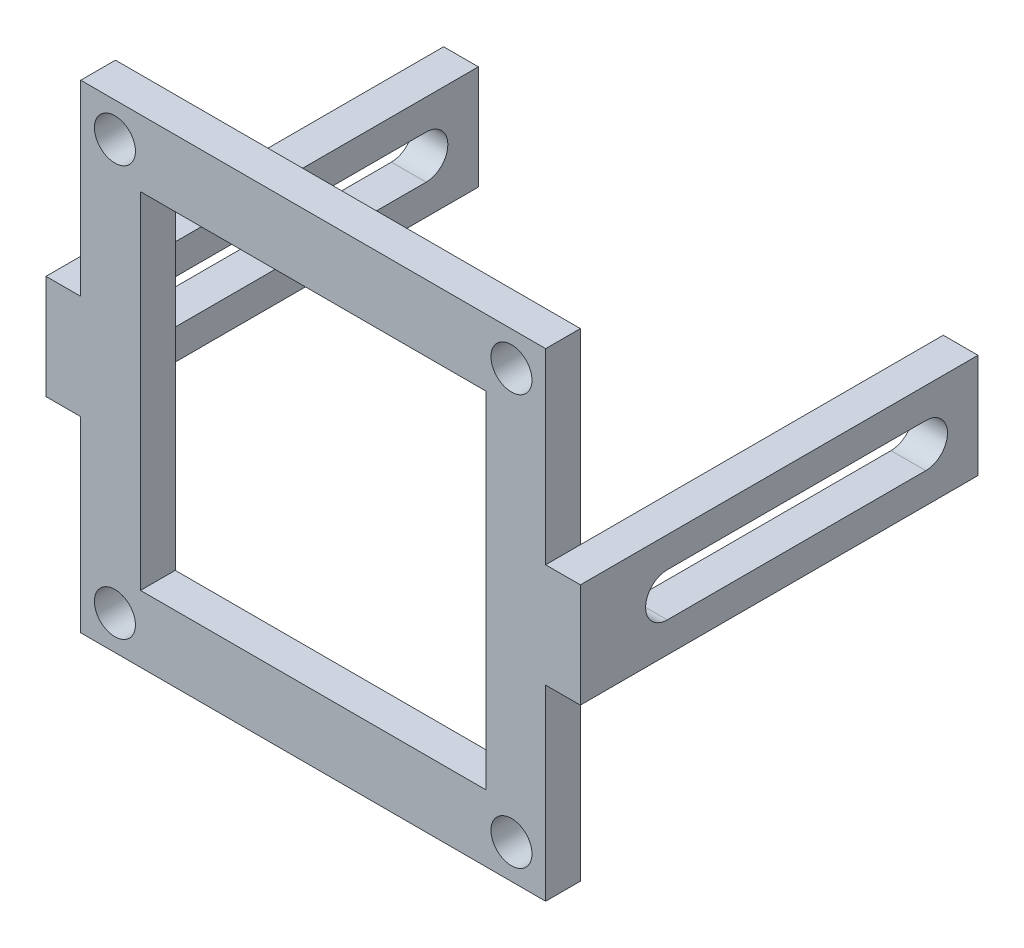
ISO-10303-21;
HEADER;
FILE_DESCRIPTION(('STEP AP214'),'2;1');
FILE_NAME('part.step','',(''),(''),'','','');
FILE_SCHEMA(('AUTOMOTIVE_DESIGN { 1 0 10303 214 1 1 1 1 }'));
ENDSEC;
DATA;
#1=APPLICATION_CONTEXT('core data for automotive mechanical design processes');
#2=APPLICATION_PROTOCOL_DEFINITION('international standard','automotive_design',2000,#1);
#3=PRODUCT_CONTEXT('',#1,'mechanical');
#4=PRODUCT('Part','Part','',(#3));
#5=PRODUCT_RELATED_PRODUCT_CATEGORY('part','',(#4));
#6=PRODUCT_DEFINITION_FORMATION('','',#4);
#7=PRODUCT_DEFINITION_CONTEXT('part definition',#1,'design');
#8=PRODUCT_DEFINITION('design','',#6,#7);
#9=PRODUCT_DEFINITION_SHAPE('','',#8);
#10=(LENGTH_UNIT() NAMED_UNIT(*) SI_UNIT(.MILLI.,.METRE.));
#11=(NAMED_UNIT(*) PLANE_ANGLE_UNIT() SI_UNIT($,.RADIAN.));
#12=(NAMED_UNIT(*) SI_UNIT($,.STERADIAN.) SOLID_ANGLE_UNIT());
#13=UNCERTAINTY_MEASURE_WITH_UNIT(LENGTH_MEASURE(1.E-05),#10,'distance_accuracy_value','');
#14=(GEOMETRIC_REPRESENTATION_CONTEXT(3) GLOBAL_UNCERTAINTY_ASSIGNED_CONTEXT((#13)) GLOBAL_UNIT_ASSIGNED_CONTEXT((#10,
#11,#12)) REPRESENTATION_CONTEXT('',''));
#15=CARTESIAN_POINT('',(0.,0.,0.));
#16=DIRECTION('',(0.,0.,1.));
#17=DIRECTION('',(1.,0.,0.));
#18=AXIS2_PLACEMENT_3D('',#15,#16,#17);
#19=CARTESIAN_POINT('',(17.,32.8650742494496,92.255589270182));
#20=DIRECTION('',(-1.,0.,0.));
#21=DIRECTION('',(0.,0.,1.));
#22=AXIS2_PLACEMENT_3D('',#19,#20,#21);
#23=PLANE('',#22);
#24=DIRECTION('',(0.,1.,0.));
#25=VECTOR('',#24,1.);
#26=CARTESIAN_POINT('',(17.,32.8650742494496,92.255589270182));
#27=LINE('',#26,#25);
#28=CARTESIAN_POINT('',(17.,19.1750742494496,92.255589270182));
#29=VERTEX_POINT('',#28);
#30=CARTESIAN_POINT('',(17.,32.8650742494496,92.255589270182));
#31=VERTEX_POINT('',#30);
#32=EDGE_CURVE('E403',#29,#31,#27,.T.);
#33=ORIENTED_EDGE('',*,*,#32,.F.);
#34=DIRECTION('',(0.,0.,-1.));
#35=VECTOR('',#34,1.);
#36=CARTESIAN_POINT('',(17.,19.1750742494496,63.1769712690575));
#37=LINE('',#36,#35);
#38=CARTESIAN_POINT('',(17.,19.1750742494496,89.715589270182));
#39=VERTEX_POINT('',#38);
#40=EDGE_CURVE('E259',#29,#39,#37,.T.);
#41=ORIENTED_EDGE('',*,*,#40,.T.);
#42=DIRECTION('',(0.,1.,0.));
#43=VECTOR('',#42,1.);
#44=CARTESIAN_POINT('',(17.,32.8650742494496,89.715589270182));
#45=LINE('',#44,#43);
#46=CARTESIAN_POINT('',(17.,32.8650742494496,89.715589270182));
#47=VERTEX_POINT('',#46);
#48=EDGE_CURVE('E415',#39,#47,#45,.T.);
#49=ORIENTED_EDGE('',*,*,#48,.T.);
#50=DIRECTION('',(0.,0.,-1.));
#51=VECTOR('',#50,1.);
#52=CARTESIAN_POINT('',(17.,32.8650742494496,92.255589270182));
#53=LINE('',#52,#51);
#54=EDGE_CURVE('E424',#31,#47,#53,.T.);
#55=ORIENTED_EDGE('',*,*,#54,.F.);
#56=EDGE_LOOP('',(#33,#41,#49,#55));
#57=FACE_BOUND('',#56,.T.);
#58=ADVANCED_FACE('F37',(#57),#23,.F.);
#59=CARTESIAN_POINT('',(-17.,32.8650742494496,92.255589270182));
#60=DIRECTION('',(1.,0.,0.));
#61=DIRECTION('',(0.,0.,-1.));
#62=AXIS2_PLACEMENT_3D('',#59,#60,#61);
#63=PLANE('',#62);
#64=DIRECTION('',(0.,0.,-1.));
#65=VECTOR('',#64,1.);
#66=CARTESIAN_POINT('',(-17.,19.1750742494496,63.1769712690575));
#67=LINE('',#66,#65);
#68=CARTESIAN_POINT('',(-17.,19.1750742494496,92.255589270182));
#69=VERTEX_POINT('',#68);
#70=CARTESIAN_POINT('',(-17.,19.1750742494496,89.715589270182));
#71=VERTEX_POINT('',#70);
#72=EDGE_CURVE('E62',#69,#71,#67,.T.);
#73=ORIENTED_EDGE('',*,*,#72,.F.);
#74=DIRECTION('',(0.,-1.,0.));
#75=VECTOR('',#74,1.);
#76=CARTESIAN_POINT('',(-17.,32.8650742494496,92.255589270182));
#77=LINE('',#76,#75);
#78=CARTESIAN_POINT('',(-17.,32.8650742494496,92.255589270182));
#79=VERTEX_POINT('',#78);
#80=EDGE_CURVE('E398',#79,#69,#77,.T.);
#81=ORIENTED_EDGE('',*,*,#80,.F.);
#82=DIRECTION('',(0.,0.,-1.));
#83=VECTOR('',#82,1.);
#84=CARTESIAN_POINT('',(-17.,32.8650742494496,92.255589270182));
#85=LINE('',#84,#83);
#86=CARTESIAN_POINT('',(-17.,32.8650742494496,89.715589270182));
#87=VERTEX_POINT('',#86);
#88=EDGE_CURVE('E409',#79,#87,#85,.T.);
#89=ORIENTED_EDGE('',*,*,#88,.T.);
#90=DIRECTION('',(0.,-1.,0.));
#91=VECTOR('',#90,1.);
#92=CARTESIAN_POINT('',(-17.,32.8650742494496,89.715589270182));
#93=LINE('',#92,#91);
#94=EDGE_CURVE('E410',#87,#71,#93,.T.);
#95=ORIENTED_EDGE('',*,*,#94,.T.);
#96=EDGE_LOOP('',(#73,#81,#89,#95));
#97=FACE_BOUND('',#96,.T.);
#98=ADVANCED_FACE('F39',(#97),#63,.F.);
#99=DIRECTION('',(0.,0.,1.));
#100=VECTOR('',#99,1.);
#101=CARTESIAN_POINT('',(-17.,11.5550742494496,89.715589270182));
#102=LINE('',#101,#100);
#103=CARTESIAN_POINT('',(-17.,11.5550742494496,89.715589270182));
#104=VERTEX_POINT('',#103);
#105=CARTESIAN_POINT('',(-17.,11.5550742494496,92.255589270182));
#106=VERTEX_POINT('',#105);
#107=EDGE_CURVE('E46',#104,#106,#102,.T.);
#108=ORIENTED_EDGE('',*,*,#107,.F.);
#109=CARTESIAN_POINT('',(-17.,-2.13492575055037,89.715589270182));
#110=VERTEX_POINT('',#109);
#111=EDGE_CURVE('E397',#104,#110,#93,.T.);
#112=ORIENTED_EDGE('',*,*,#111,.T.);
#113=DIRECTION('',(0.,0.,-1.));
#114=VECTOR('',#113,1.);
#115=CARTESIAN_POINT('',(-17.,-2.13492575055037,92.255589270182));
#116=LINE('',#115,#114);
#117=CARTESIAN_POINT('',(-17.,-2.13492575055037,92.255589270182));
#118=VERTEX_POINT('',#117);
#119=EDGE_CURVE('E41',#118,#110,#116,.T.);
#120=ORIENTED_EDGE('',*,*,#119,.F.);
#121=EDGE_CURVE('E401',#106,#118,#77,.T.);
#122=ORIENTED_EDGE('',*,*,#121,.F.);
#123=EDGE_LOOP('',(#108,#112,#120,#122));
#124=FACE_BOUND('',#123,.T.);
#125=ADVANCED_FACE('F465',(#124),#63,.F.);
#126=CARTESIAN_POINT('',(0.,0.,92.255589270182));
#127=DIRECTION('',(0.,0.,1.));
#128=DIRECTION('',(1.,0.,0.));
#129=AXIS2_PLACEMENT_3D('',#126,#127,#128);
#130=PLANE('',#129);
#131=CARTESIAN_POINT('',(14.5,0.365074249449635,92.255589270182));
#132=DIRECTION('',(0.,0.,1.));
#133=DIRECTION('',(1.,0.,0.));
#134=AXIS2_PLACEMENT_3D('',#131,#132,#133);
#135=CIRCLE('',#134,1.5);
#136=CARTESIAN_POINT('',(16.,0.365074249449635,92.255589270182));
#137=VERTEX_POINT('',#136);
#138=EDGE_CURVE('E349',#137,#137,#135,.T.);
#139=ORIENTED_EDGE('',*,*,#138,.F.);
#140=EDGE_LOOP('',(#139));
#141=FACE_BOUND('',#140,.T.);
#142=CARTESIAN_POINT('',(-14.5,30.3650742494496,92.255589270182));
#143=DIRECTION('',(0.,0.,1.));
#144=DIRECTION('',(1.,0.,0.));
#145=AXIS2_PLACEMENT_3D('',#142,#143,#144);
#146=CIRCLE('',#145,1.5);
#147=CARTESIAN_POINT('',(-13.,30.3650742494496,92.255589270182));
#148=VERTEX_POINT('',#147);
#149=EDGE_CURVE('E361',#148,#148,#146,.T.);
#150=ORIENTED_EDGE('',*,*,#149,.F.);
#151=EDGE_LOOP('',(#150));
#152=FACE_BOUND('',#151,.T.);
#153=ORIENTED_EDGE('',*,*,#80,.T.);
#154=DIRECTION('',(1.,0.,0.));
#155=VECTOR('',#154,1.);
#156=CARTESIAN_POINT('',(-19.54,19.1750742494496,92.255589270182));
#157=LINE('',#156,#155);
#158=CARTESIAN_POINT('',(-19.54,19.1750742494496,92.255589270182));
#159=VERTEX_POINT('',#158);
#160=EDGE_CURVE('E324',#159,#69,#157,.T.);
#161=ORIENTED_EDGE('',*,*,#160,.F.);
#162=DIRECTION('',(0.,1.,0.));
#163=VECTOR('',#162,1.);
#164=CARTESIAN_POINT('',(-19.54,11.5550742494496,92.255589270182));
#165=LINE('',#164,#163);
#166=CARTESIAN_POINT('',(-19.54,11.5550742494496,92.255589270182));
#167=VERTEX_POINT('',#166);
#168=EDGE_CURVE('E322',#167,#159,#165,.T.);
#169=ORIENTED_EDGE('',*,*,#168,.F.);
#170=DIRECTION('',(1.,0.,0.));
#171=VECTOR('',#170,1.);
#172=CARTESIAN_POINT('',(-19.54,11.5550742494496,92.255589270182));
#173=LINE('',#172,#171);
#174=EDGE_CURVE('E333',#167,#106,#173,.T.);
#175=ORIENTED_EDGE('',*,*,#174,.T.);
#176=ORIENTED_EDGE('',*,*,#121,.T.);
#177=DIRECTION('',(1.,0.,0.));
#178=VECTOR('',#177,1.);
#179=CARTESIAN_POINT('',(-17.,-2.13492575055037,92.255589270182));
#180=LINE('',#179,#178);
#181=CARTESIAN_POINT('',(17.,-2.13492575055037,92.255589270182));
#182=VERTEX_POINT('',#181);
#183=EDGE_CURVE('E400',#118,#182,#180,.T.);
#184=ORIENTED_EDGE('',*,*,#183,.T.);
#185=CARTESIAN_POINT('',(17.,11.5550742494496,92.255589270182));
#186=VERTEX_POINT('',#185);
#187=EDGE_CURVE('E404',#182,#186,#27,.T.);
#188=ORIENTED_EDGE('',*,*,#187,.T.);
#189=DIRECTION('',(-1.,0.,0.));
#190=VECTOR('',#189,1.);
#191=CARTESIAN_POINT('',(19.54,11.5550742494496,92.255589270182));
#192=LINE('',#191,#190);
#193=CARTESIAN_POINT('',(19.54,11.5550742494496,92.255589270182));
#194=VERTEX_POINT('',#193);
#195=EDGE_CURVE('E55',#194,#186,#192,.T.);
#196=ORIENTED_EDGE('',*,*,#195,.F.);
#197=DIRECTION('',(0.,1.,0.));
#198=VECTOR('',#197,1.);
#199=CARTESIAN_POINT('',(19.54,11.5550742494496,92.255589270182));
#200=LINE('',#199,#198);
#201=CARTESIAN_POINT('',(19.54,19.1750742494496,92.255589270182));
#202=VERTEX_POINT('',#201);
#203=EDGE_CURVE('E258',#194,#202,#200,.T.);
#204=ORIENTED_EDGE('',*,*,#203,.T.);
#205=DIRECTION('',(-1.,0.,0.));
#206=VECTOR('',#205,1.);
#207=CARTESIAN_POINT('',(19.54,19.1750742494496,92.255589270182));
#208=LINE('',#207,#206);
#209=EDGE_CURVE('E280',#202,#29,#208,.T.);
#210=ORIENTED_EDGE('',*,*,#209,.T.);
#211=ORIENTED_EDGE('',*,*,#32,.T.);
#212=DIRECTION('',(-1.,0.,0.));
#213=VECTOR('',#212,1.);
#214=CARTESIAN_POINT('',(-17.,32.8650742494496,92.255589270182));
#215=LINE('',#214,#213);
#216=EDGE_CURVE('E407',#31,#79,#215,.T.);
#217=ORIENTED_EDGE('',*,*,#216,.T.);
#218=EDGE_LOOP('',(#153,#161,#169,#175,#176,#184,#188,#196,#204,#210,#211,#217));
#219=FACE_BOUND('',#218,.T.);
#220=DIRECTION('',(1.,0.,0.));
#221=VECTOR('',#220,1.);
#222=CARTESIAN_POINT('',(-12.6270234275931,2.73805082185656,92.255589270182));
#223=LINE('',#222,#221);
#224=CARTESIAN_POINT('',(-12.6270234275931,2.73805082185656,92.255589270182));
#225=VERTEX_POINT('',#224);
#226=CARTESIAN_POINT('',(12.6270234275931,2.73805082185656,92.255589270182));
#227=VERTEX_POINT('',#226);
#228=EDGE_CURVE('E369',#225,#227,#223,.T.);
#229=ORIENTED_EDGE('',*,*,#228,.F.);
#230=DIRECTION('',(0.,-1.,0.));
#231=VECTOR('',#230,1.);
#232=CARTESIAN_POINT('',(-12.6270234275931,2.73805082185656,92.255589270182));
#233=LINE('',#232,#231);
#234=CARTESIAN_POINT('',(-12.6270234275931,27.9920976770427,92.255589270182));
#235=VERTEX_POINT('',#234);
#236=EDGE_CURVE('E367',#235,#225,#233,.T.);
#237=ORIENTED_EDGE('',*,*,#236,.F.);
#238=DIRECTION('',(-1.,0.,0.));
#239=VECTOR('',#238,1.);
#240=CARTESIAN_POINT('',(-12.6270234275931,27.9920976770427,92.255589270182));
#241=LINE('',#240,#239);
#242=CARTESIAN_POINT('',(12.6270234275931,27.9920976770427,92.255589270182));
#243=VERTEX_POINT('',#242);
#244=EDGE_CURVE('E375',#243,#235,#241,.T.);
#245=ORIENTED_EDGE('',*,*,#244,.F.);
#246=DIRECTION('',(0.,1.,0.));
#247=VECTOR('',#246,1.);
#248=CARTESIAN_POINT('',(12.6270234275931,2.73805082185656,92.255589270182));
#249=LINE('',#248,#247);
#250=EDGE_CURVE('E372',#227,#243,#249,.T.);
#251=ORIENTED_EDGE('',*,*,#250,.F.);
#252=EDGE_LOOP('',(#229,#237,#245,#251));
#253=FACE_BOUND('',#252,.T.);
#254=CARTESIAN_POINT('',(14.5,30.3650742494496,92.255589270182));
#255=DIRECTION('',(0.,0.,1.));
#256=DIRECTION('',(-1.,0.,0.));
#257=AXIS2_PLACEMENT_3D('',#254,#255,#256);
#258=CIRCLE('',#257,1.5);
#259=CARTESIAN_POINT('',(13.,30.3650742494496,92.255589270182));
#260=VERTEX_POINT('',#259);
#261=EDGE_CURVE('E355',#260,#260,#258,.T.);
#262=ORIENTED_EDGE('',*,*,#261,.F.);
#263=EDGE_LOOP('',(#262));
#264=FACE_BOUND('',#263,.T.);
#265=CARTESIAN_POINT('',(-14.5,0.365074249449635,92.255589270182));
#266=DIRECTION('',(0.,0.,1.));
#267=DIRECTION('',(-1.,0.,0.));
#268=AXIS2_PLACEMENT_3D('',#265,#266,#267);
#269=CIRCLE('',#268,1.5);
#270=CARTESIAN_POINT('',(-16.,0.365074249449635,92.255589270182));
#271=VERTEX_POINT('',#270);
#272=EDGE_CURVE('E343',#271,#271,#269,.T.);
#273=ORIENTED_EDGE('',*,*,#272,.F.);
#274=EDGE_LOOP('',(#273));
#275=FACE_BOUND('',#274,.T.);
#276=ADVANCED_FACE('F445',(#141,#152,#219,#253,#264,#275),#130,.T.);
#277=CARTESIAN_POINT('',(0.,0.,89.715589270182));
#278=DIRECTION('',(0.,0.,1.));
#279=DIRECTION('',(1.,0.,0.));
#280=AXIS2_PLACEMENT_3D('',#277,#278,#279);
#281=PLANE('',#280);
#282=ORIENTED_EDGE('',*,*,#94,.F.);
#283=DIRECTION('',(-1.,0.,0.));
#284=VECTOR('',#283,1.);
#285=CARTESIAN_POINT('',(-17.,32.8650742494496,89.715589270182));
#286=LINE('',#285,#284);
#287=EDGE_CURVE('E419',#47,#87,#286,.T.);
#288=ORIENTED_EDGE('',*,*,#287,.F.);
#289=ORIENTED_EDGE('',*,*,#48,.F.);
#290=CARTESIAN_POINT('',(17.,11.5550742494496,89.715589270182));
#291=VERTEX_POINT('',#290);
#292=EDGE_CURVE('E420',#291,#39,#45,.T.);
#293=ORIENTED_EDGE('',*,*,#292,.F.);
#294=CARTESIAN_POINT('',(17.,-2.13492575055037,89.715589270182));
#295=VERTEX_POINT('',#294);
#296=EDGE_CURVE('E416',#295,#291,#45,.T.);
#297=ORIENTED_EDGE('',*,*,#296,.F.);
#298=DIRECTION('',(1.,0.,0.));
#299=VECTOR('',#298,1.);
#300=CARTESIAN_POINT('',(-17.,-2.13492575055037,89.715589270182));
#301=LINE('',#300,#299);
#302=EDGE_CURVE('E412',#110,#295,#301,.T.);
#303=ORIENTED_EDGE('',*,*,#302,.F.);
#304=ORIENTED_EDGE('',*,*,#111,.F.);
#305=EDGE_CURVE('E413',#71,#104,#93,.T.);
#306=ORIENTED_EDGE('',*,*,#305,.F.);
#307=EDGE_LOOP('',(#282,#288,#289,#293,#297,#303,#304,#306));
#308=FACE_BOUND('',#307,.T.);
#309=DIRECTION('',(0.,-1.,0.));
#310=VECTOR('',#309,1.);
#311=CARTESIAN_POINT('',(-12.6270234275931,2.73805082185656,89.715589270182));
#312=LINE('',#311,#310);
#313=CARTESIAN_POINT('',(-12.6270234275931,27.9920976770427,89.715589270182));
#314=VERTEX_POINT('',#313);
#315=CARTESIAN_POINT('',(-12.6270234275931,2.73805082185656,89.715589270182));
#316=VERTEX_POINT('',#315);
#317=EDGE_CURVE('E364',#314,#316,#312,.T.);
#318=ORIENTED_EDGE('',*,*,#317,.T.);
#319=DIRECTION('',(1.,0.,0.));
#320=VECTOR('',#319,1.);
#321=CARTESIAN_POINT('',(-12.6270234275931,2.73805082185656,89.715589270182));
#322=LINE('',#321,#320);
#323=CARTESIAN_POINT('',(12.6270234275931,2.73805082185656,89.715589270182));
#324=VERTEX_POINT('',#323);
#325=EDGE_CURVE('E380',#316,#324,#322,.T.);
#326=ORIENTED_EDGE('',*,*,#325,.T.);
#327=DIRECTION('',(0.,1.,0.));
#328=VECTOR('',#327,1.);
#329=CARTESIAN_POINT('',(12.6270234275931,2.73805082185656,89.715589270182));
#330=LINE('',#329,#328);
#331=CARTESIAN_POINT('',(12.6270234275931,27.9920976770427,89.715589270182));
#332=VERTEX_POINT('',#331);
#333=EDGE_CURVE('E383',#324,#332,#330,.T.);
#334=ORIENTED_EDGE('',*,*,#333,.T.);
#335=DIRECTION('',(-1.,0.,0.));
#336=VECTOR('',#335,1.);
#337=CARTESIAN_POINT('',(-12.6270234275931,27.9920976770427,89.715589270182));
#338=LINE('',#337,#336);
#339=EDGE_CURVE('E370',#332,#314,#338,.T.);
#340=ORIENTED_EDGE('',*,*,#339,.T.);
#341=EDGE_LOOP('',(#318,#326,#334,#340));
#342=FACE_BOUND('',#341,.T.);
#343=CARTESIAN_POINT('',(-14.5,30.3650742494496,89.715589270182));
#344=DIRECTION('',(0.,0.,1.));
#345=DIRECTION('',(1.,0.,0.));
#346=AXIS2_PLACEMENT_3D('',#343,#344,#345);
#347=CIRCLE('',#346,1.5);
#348=CARTESIAN_POINT('',(-13.,30.3650742494496,89.715589270182));
#349=VERTEX_POINT('',#348);
#350=EDGE_CURVE('E358',#349,#349,#347,.T.);
#351=ORIENTED_EDGE('',*,*,#350,.T.);
#352=EDGE_LOOP('',(#351));
#353=FACE_BOUND('',#352,.T.);
#354=CARTESIAN_POINT('',(14.5,30.3650742494496,89.715589270182));
#355=DIRECTION('',(0.,0.,1.));
#356=DIRECTION('',(-1.,0.,0.));
#357=AXIS2_PLACEMENT_3D('',#354,#355,#356);
#358=CIRCLE('',#357,1.5);
#359=CARTESIAN_POINT('',(13.,30.3650742494496,89.715589270182));
#360=VERTEX_POINT('',#359);
#361=EDGE_CURVE('E352',#360,#360,#358,.T.);
#362=ORIENTED_EDGE('',*,*,#361,.T.);
#363=EDGE_LOOP('',(#362));
#364=FACE_BOUND('',#363,.T.);
#365=CARTESIAN_POINT('',(14.5,0.365074249449635,89.715589270182));
#366=DIRECTION('',(0.,0.,1.));
#367=DIRECTION('',(1.,0.,0.));
#368=AXIS2_PLACEMENT_3D('',#365,#366,#367);
#369=CIRCLE('',#368,1.5);
#370=CARTESIAN_POINT('',(16.,0.365074249449635,89.715589270182));
#371=VERTEX_POINT('',#370);
#372=EDGE_CURVE('E346',#371,#371,#369,.T.);
#373=ORIENTED_EDGE('',*,*,#372,.T.);
#374=EDGE_LOOP('',(#373));
#375=FACE_BOUND('',#374,.T.);
#376=CARTESIAN_POINT('',(-14.5,0.365074249449635,89.715589270182));
#377=DIRECTION('',(0.,0.,1.));
#378=DIRECTION('',(-1.,0.,0.));
#379=AXIS2_PLACEMENT_3D('',#376,#377,#378);
#380=CIRCLE('',#379,1.5);
#381=CARTESIAN_POINT('',(-16.,0.365074249449635,89.715589270182));
#382=VERTEX_POINT('',#381);
#383=EDGE_CURVE('E342',#382,#382,#380,.T.);
#384=ORIENTED_EDGE('',*,*,#383,.T.);
#385=EDGE_LOOP('',(#384));
#386=FACE_BOUND('',#385,.T.);
#387=ADVANCED_FACE('F466',(#308,#342,#353,#364,#375,#386),#281,.F.);
#388=CARTESIAN_POINT('',(-17.,-2.13492575055037,92.255589270182));
#389=DIRECTION('',(0.,1.,0.));
#390=DIRECTION('',(0.,0.,1.));
#391=AXIS2_PLACEMENT_3D('',#388,#389,#390);
#392=PLANE('',#391);
#393=ORIENTED_EDGE('',*,*,#302,.T.);
#394=DIRECTION('',(0.,0.,-1.));
#395=VECTOR('',#394,1.);
#396=CARTESIAN_POINT('',(17.,-2.13492575055037,92.255589270182));
#397=LINE('',#396,#395);
#398=EDGE_CURVE('E426',#182,#295,#397,.T.);
#399=ORIENTED_EDGE('',*,*,#398,.F.);
#400=ORIENTED_EDGE('',*,*,#183,.F.);
#401=ORIENTED_EDGE('',*,*,#119,.T.);
#402=EDGE_LOOP('',(#393,#399,#400,#401));
#403=FACE_BOUND('',#402,.T.);
#404=ADVANCED_FACE('F469',(#403),#392,.F.);
#405=ORIENTED_EDGE('',*,*,#296,.T.);
#406=DIRECTION('',(0.,0.,1.));
#407=VECTOR('',#406,1.);
#408=CARTESIAN_POINT('',(17.,11.5550742494496,63.1769712690575));
#409=LINE('',#408,#407);
#410=EDGE_CURVE('E11',#291,#186,#409,.T.);
#411=ORIENTED_EDGE('',*,*,#410,.T.);
#412=ORIENTED_EDGE('',*,*,#187,.F.);
#413=ORIENTED_EDGE('',*,*,#398,.T.);
#414=EDGE_LOOP('',(#405,#411,#412,#413));
#415=FACE_BOUND('',#414,.T.);
#416=ADVANCED_FACE('F470',(#415),#23,.F.);
#417=CARTESIAN_POINT('',(-17.,32.8650742494496,92.255589270182));
#418=DIRECTION('',(0.,-1.,0.));
#419=DIRECTION('',(0.,0.,-1.));
#420=AXIS2_PLACEMENT_3D('',#417,#418,#419);
#421=PLANE('',#420);
#422=ORIENTED_EDGE('',*,*,#287,.T.);
#423=ORIENTED_EDGE('',*,*,#88,.F.);
#424=ORIENTED_EDGE('',*,*,#216,.F.);
#425=ORIENTED_EDGE('',*,*,#54,.T.);
#426=EDGE_LOOP('',(#422,#423,#424,#425));
#427=FACE_BOUND('',#426,.T.);
#428=ADVANCED_FACE('F492',(#427),#421,.F.);
#429=CARTESIAN_POINT('',(-12.6270234275931,2.73805082185656,92.255589270182));
#430=DIRECTION('',(1.,0.,0.));
#431=DIRECTION('',(0.,0.,-1.));
#432=AXIS2_PLACEMENT_3D('',#429,#430,#431);
#433=PLANE('',#432);
#434=ORIENTED_EDGE('',*,*,#317,.F.);
#435=DIRECTION('',(0.,0.,-1.));
#436=VECTOR('',#435,1.);
#437=CARTESIAN_POINT('',(-12.6270234275931,27.9920976770427,92.255589270182));
#438=LINE('',#437,#436);
#439=EDGE_CURVE('E377',#235,#314,#438,.T.);
#440=ORIENTED_EDGE('',*,*,#439,.F.);
#441=ORIENTED_EDGE('',*,*,#236,.T.);
#442=DIRECTION('',(0.,0.,-1.));
#443=VECTOR('',#442,1.);
#444=CARTESIAN_POINT('',(-12.6270234275931,2.73805082185656,92.255589270182));
#445=LINE('',#444,#443);
#446=EDGE_CURVE('E394',#225,#316,#445,.T.);
#447=ORIENTED_EDGE('',*,*,#446,.T.);
#448=EDGE_LOOP('',(#434,#440,#441,#447));
#449=FACE_BOUND('',#448,.T.);
#450=ADVANCED_FACE('F515',(#449),#433,.T.);
#451=CARTESIAN_POINT('',(-12.6270234275931,2.73805082185656,92.255589270182));
#452=DIRECTION('',(0.,1.,0.));
#453=DIRECTION('',(-1.,0.,0.));
#454=AXIS2_PLACEMENT_3D('',#451,#452,#453);
#455=PLANE('',#454);
#456=ORIENTED_EDGE('',*,*,#325,.F.);
#457=ORIENTED_EDGE('',*,*,#446,.F.);
#458=ORIENTED_EDGE('',*,*,#228,.T.);
#459=DIRECTION('',(0.,0.,-1.));
#460=VECTOR('',#459,1.);
#461=CARTESIAN_POINT('',(12.6270234275931,2.73805082185656,92.255589270182));
#462=LINE('',#461,#460);
#463=EDGE_CURVE('E392',#227,#324,#462,.T.);
#464=ORIENTED_EDGE('',*,*,#463,.T.);
#465=EDGE_LOOP('',(#456,#457,#458,#464));
#466=FACE_BOUND('',#465,.T.);
#467=ADVANCED_FACE('F528',(#466),#455,.T.);
#468=CARTESIAN_POINT('',(12.6270234275931,2.73805082185656,92.255589270182));
#469=DIRECTION('',(-1.,0.,0.));
#470=DIRECTION('',(0.,-1.,0.));
#471=AXIS2_PLACEMENT_3D('',#468,#469,#470);
#472=PLANE('',#471);
#473=ORIENTED_EDGE('',*,*,#333,.F.);
#474=ORIENTED_EDGE('',*,*,#463,.F.);
#475=ORIENTED_EDGE('',*,*,#250,.T.);
#476=DIRECTION('',(0.,0.,-1.));
#477=VECTOR('',#476,1.);
#478=CARTESIAN_POINT('',(12.6270234275931,27.9920976770427,92.255589270182));
#479=LINE('',#478,#477);
#480=EDGE_CURVE('E390',#243,#332,#479,.T.);
#481=ORIENTED_EDGE('',*,*,#480,.T.);
#482=EDGE_LOOP('',(#473,#474,#475,#481));
#483=FACE_BOUND('',#482,.T.);
#484=ADVANCED_FACE('F532',(#483),#472,.T.);
#485=CARTESIAN_POINT('',(-12.6270234275931,27.9920976770427,92.255589270182));
#486=DIRECTION('',(0.,-1.,0.));
#487=DIRECTION('',(0.,0.,-1.));
#488=AXIS2_PLACEMENT_3D('',#485,#486,#487);
#489=PLANE('',#488);
#490=ORIENTED_EDGE('',*,*,#339,.F.);
#491=ORIENTED_EDGE('',*,*,#480,.F.);
#492=ORIENTED_EDGE('',*,*,#244,.T.);
#493=ORIENTED_EDGE('',*,*,#439,.T.);
#494=EDGE_LOOP('',(#490,#491,#492,#493));
#495=FACE_BOUND('',#494,.T.);
#496=ADVANCED_FACE('F536',(#495),#489,.T.);
#497=CARTESIAN_POINT('',(-14.5,30.3650742494496,92.255589270182));
#498=DIRECTION('',(0.,0.,-1.));
#499=DIRECTION('',(-1.,0.,0.));
#500=AXIS2_PLACEMENT_3D('',#497,#498,#499);
#501=CYLINDRICAL_SURFACE('',#500,1.5);
#502=ORIENTED_EDGE('',*,*,#149,.T.);
#503=EDGE_LOOP('',(#502));
#504=FACE_BOUND('',#503,.T.);
#505=ORIENTED_EDGE('',*,*,#350,.F.);
#506=EDGE_LOOP('',(#505));
#507=FACE_BOUND('',#506,.T.);
#508=ADVANCED_FACE('F540',(#504,#507),#501,.F.);
#509=CARTESIAN_POINT('',(14.5,30.3650742494496,92.255589270182));
#510=DIRECTION('',(0.,0.,-1.));
#511=DIRECTION('',(-1.,0.,0.));
#512=AXIS2_PLACEMENT_3D('',#509,#510,#511);
#513=CYLINDRICAL_SURFACE('',#512,1.5);
#514=ORIENTED_EDGE('',*,*,#261,.T.);
#515=EDGE_LOOP('',(#514));
#516=FACE_BOUND('',#515,.T.);
#517=ORIENTED_EDGE('',*,*,#361,.F.);
#518=EDGE_LOOP('',(#517));
#519=FACE_BOUND('',#518,.T.);
#520=ADVANCED_FACE('F544',(#516,#519),#513,.F.);
#521=CARTESIAN_POINT('',(14.5,0.365074249449635,92.255589270182));
#522=DIRECTION('',(0.,0.,-1.));
#523=DIRECTION('',(-1.,0.,0.));
#524=AXIS2_PLACEMENT_3D('',#521,#522,#523);
#525=CYLINDRICAL_SURFACE('',#524,1.5);
#526=ORIENTED_EDGE('',*,*,#138,.T.);
#527=EDGE_LOOP('',(#526));
#528=FACE_BOUND('',#527,.T.);
#529=ORIENTED_EDGE('',*,*,#372,.F.);
#530=EDGE_LOOP('',(#529));
#531=FACE_BOUND('',#530,.T.);
#532=ADVANCED_FACE('F548',(#528,#531),#525,.F.);
#533=CARTESIAN_POINT('',(-14.5,0.365074249449635,92.255589270182));
#534=DIRECTION('',(0.,0.,-1.));
#535=DIRECTION('',(-1.,0.,0.));
#536=AXIS2_PLACEMENT_3D('',#533,#534,#535);
#537=CYLINDRICAL_SURFACE('',#536,1.5);
#538=ORIENTED_EDGE('',*,*,#272,.T.);
#539=EDGE_LOOP('',(#538));
#540=FACE_BOUND('',#539,.T.);
#541=ORIENTED_EDGE('',*,*,#383,.F.);
#542=EDGE_LOOP('',(#541));
#543=FACE_BOUND('',#542,.T.);
#544=ADVANCED_FACE('F551',(#540,#543),#537,.F.);
#545=CARTESIAN_POINT('',(-17.,0.,0.));
#546=DIRECTION('',(-1.,0.,0.));
#547=DIRECTION('',(0.,0.,1.));
#548=AXIS2_PLACEMENT_3D('',#545,#546,#547);
#549=PLANE('',#548);
#550=CARTESIAN_POINT('',(-17.,15.3650742494496,66.9966026229374));
#551=DIRECTION('',(-1.,0.,0.));
#552=DIRECTION('',(0.,0.,1.));
#553=AXIS2_PLACEMENT_3D('',#550,#551,#552);
#554=CIRCLE('',#553,1.5875);
#555=CARTESIAN_POINT('',(-17.,16.9525742494496,66.9966026229374));
#556=VERTEX_POINT('',#555);
#557=CARTESIAN_POINT('',(-17.,13.7775742494496,66.9966026229374));
#558=VERTEX_POINT('',#557);
#559=EDGE_CURVE('E283',#556,#558,#554,.T.);
#560=ORIENTED_EDGE('',*,*,#559,.T.);
#561=DIRECTION('',(0.,0.,1.));
#562=VECTOR('',#561,1.);
#563=CARTESIAN_POINT('',(-17.,13.7775742494496,66.9966026229374));
#564=LINE('',#563,#562);
#565=CARTESIAN_POINT('',(-17.,13.7775742494496,85.8959579163021));
#566=VERTEX_POINT('',#565);
#567=EDGE_CURVE('E297',#558,#566,#564,.T.);
#568=ORIENTED_EDGE('',*,*,#567,.T.);
#569=CARTESIAN_POINT('',(-17.,15.3650742494496,85.8959579163021));
#570=DIRECTION('',(-1.,0.,0.));
#571=DIRECTION('',(0.,0.,1.));
#572=AXIS2_PLACEMENT_3D('',#569,#570,#571);
#573=CIRCLE('',#572,1.5875);
#574=CARTESIAN_POINT('',(-17.,16.9525742494496,85.8959579163021));
#575=VERTEX_POINT('',#574);
#576=EDGE_CURVE('E300',#566,#575,#573,.T.);
#577=ORIENTED_EDGE('',*,*,#576,.T.);
#578=DIRECTION('',(0.,0.,-1.));
#579=VECTOR('',#578,1.);
#580=CARTESIAN_POINT('',(-17.,16.9525742494496,66.9966026229374));
#581=LINE('',#580,#579);
#582=EDGE_CURVE('E287',#575,#556,#581,.T.);
#583=ORIENTED_EDGE('',*,*,#582,.T.);
#584=EDGE_LOOP('',(#560,#568,#577,#583));
#585=FACE_BOUND('',#584,.T.);
#586=CARTESIAN_POINT('',(-17.,19.1750742494496,63.1769712690575));
#587=VERTEX_POINT('',#586);
#588=EDGE_CURVE('E314',#71,#587,#67,.T.);
#589=ORIENTED_EDGE('',*,*,#588,.F.);
#590=ORIENTED_EDGE('',*,*,#305,.T.);
#591=CARTESIAN_POINT('',(-17.,11.5550742494496,63.1769712690575));
#592=VERTEX_POINT('',#591);
#593=EDGE_CURVE('E318',#592,#104,#102,.T.);
#594=ORIENTED_EDGE('',*,*,#593,.F.);
#595=DIRECTION('',(0.,-1.,0.));
#596=VECTOR('',#595,1.);
#597=CARTESIAN_POINT('',(-17.,11.5550742494496,63.1769712690575));
#598=LINE('',#597,#596);
#599=EDGE_CURVE('E326',#587,#592,#598,.T.);
#600=ORIENTED_EDGE('',*,*,#599,.F.);
#601=EDGE_LOOP('',(#589,#590,#594,#600));
#602=FACE_BOUND('',#601,.T.);
#603=ADVANCED_FACE('F460',(#585,#602),#549,.F.);
#604=CARTESIAN_POINT('',(-19.54,0.,0.));
#605=DIRECTION('',(-1.,0.,0.));
#606=DIRECTION('',(0.,0.,1.));
#607=AXIS2_PLACEMENT_3D('',#604,#605,#606);
#608=PLANE('',#607);
#609=DIRECTION('',(0.,0.,-1.));
#610=VECTOR('',#609,1.);
#611=CARTESIAN_POINT('',(-19.54,19.1750742494496,89.715589270182));
#612=LINE('',#611,#610);
#613=CARTESIAN_POINT('',(-19.54,19.1750742494496,63.1769712690575));
#614=VERTEX_POINT('',#613);
#615=EDGE_CURVE('E315',#159,#614,#612,.T.);
#616=ORIENTED_EDGE('',*,*,#615,.T.);
#617=DIRECTION('',(0.,-1.,0.));
#618=VECTOR('',#617,1.);
#619=CARTESIAN_POINT('',(-19.54,11.5550742494496,63.1769712690575));
#620=LINE('',#619,#618);
#621=CARTESIAN_POINT('',(-19.54,11.5550742494496,63.1769712690575));
#622=VERTEX_POINT('',#621);
#623=EDGE_CURVE('E317',#614,#622,#620,.T.);
#624=ORIENTED_EDGE('',*,*,#623,.T.);
#625=DIRECTION('',(0.,0.,1.));
#626=VECTOR('',#625,1.);
#627=CARTESIAN_POINT('',(-19.54,11.5550742494496,63.1769712690575));
#628=LINE('',#627,#626);
#629=EDGE_CURVE('E320',#622,#167,#628,.T.);
#630=ORIENTED_EDGE('',*,*,#629,.T.);
#631=ORIENTED_EDGE('',*,*,#168,.T.);
#632=EDGE_LOOP('',(#616,#624,#630,#631));
#633=FACE_BOUND('',#632,.T.);
#634=DIRECTION('',(0.,0.,1.));
#635=VECTOR('',#634,1.);
#636=CARTESIAN_POINT('',(-19.54,13.7775742494496,66.9966026229374));
#637=LINE('',#636,#635);
#638=CARTESIAN_POINT('',(-19.54,13.7775742494496,66.9966026229374));
#639=VERTEX_POINT('',#638);
#640=CARTESIAN_POINT('',(-19.54,13.7775742494496,85.8959579163021));
#641=VERTEX_POINT('',#640);
#642=EDGE_CURVE('E286',#639,#641,#637,.T.);
#643=ORIENTED_EDGE('',*,*,#642,.F.);
#644=CARTESIAN_POINT('',(-19.54,15.3650742494496,66.9966026229374));
#645=DIRECTION('',(-1.,0.,0.));
#646=DIRECTION('',(0.,0.,1.));
#647=AXIS2_PLACEMENT_3D('',#644,#645,#646);
#648=CIRCLE('',#647,1.5875);
#649=CARTESIAN_POINT('',(-19.54,16.9525742494496,66.9966026229374));
#650=VERTEX_POINT('',#649);
#651=EDGE_CURVE('E284',#650,#639,#648,.T.);
#652=ORIENTED_EDGE('',*,*,#651,.F.);
#653=DIRECTION('',(0.,0.,-1.));
#654=VECTOR('',#653,1.);
#655=CARTESIAN_POINT('',(-19.54,16.9525742494496,66.9966026229374));
#656=LINE('',#655,#654);
#657=CARTESIAN_POINT('',(-19.54,16.9525742494496,85.8959579163021));
#658=VERTEX_POINT('',#657);
#659=EDGE_CURVE('E292',#658,#650,#656,.T.);
#660=ORIENTED_EDGE('',*,*,#659,.F.);
#661=CARTESIAN_POINT('',(-19.54,15.3650742494496,85.8959579163021));
#662=DIRECTION('',(-1.,0.,0.));
#663=DIRECTION('',(0.,0.,1.));
#664=AXIS2_PLACEMENT_3D('',#661,#662,#663);
#665=CIRCLE('',#664,1.5875);
#666=EDGE_CURVE('E289',#641,#658,#665,.T.);
#667=ORIENTED_EDGE('',*,*,#666,.F.);
#668=EDGE_LOOP('',(#643,#652,#660,#667));
#669=FACE_BOUND('',#668,.T.);
#670=ADVANCED_FACE('F450',(#633,#669),#608,.T.);
#671=CARTESIAN_POINT('',(-19.54,19.1750742494496,63.1769712690575));
#672=DIRECTION('',(0.,-1.,0.));
#673=DIRECTION('',(0.,0.,-1.));
#674=AXIS2_PLACEMENT_3D('',#671,#672,#673);
#675=PLANE('',#674);
#676=ORIENTED_EDGE('',*,*,#72,.T.);
#677=ORIENTED_EDGE('',*,*,#588,.T.);
#678=DIRECTION('',(1.,0.,0.));
#679=VECTOR('',#678,1.);
#680=CARTESIAN_POINT('',(-19.54,19.1750742494496,63.1769712690575));
#681=LINE('',#680,#679);
#682=EDGE_CURVE('E339',#614,#587,#681,.T.);
#683=ORIENTED_EDGE('',*,*,#682,.F.);
#684=ORIENTED_EDGE('',*,*,#615,.F.);
#685=ORIENTED_EDGE('',*,*,#160,.T.);
#686=EDGE_LOOP('',(#676,#677,#683,#684,#685));
#687=FACE_BOUND('',#686,.T.);
#688=ADVANCED_FACE('F494',(#687),#675,.F.);
#689=CARTESIAN_POINT('',(-19.54,11.5550742494496,63.1769712690575));
#690=DIRECTION('',(0.,0.,1.));
#691=DIRECTION('',(1.,0.,0.));
#692=AXIS2_PLACEMENT_3D('',#689,#690,#691);
#693=PLANE('',#692);
#694=ORIENTED_EDGE('',*,*,#599,.T.);
#695=DIRECTION('',(1.,0.,0.));
#696=VECTOR('',#695,1.);
#697=CARTESIAN_POINT('',(-19.54,11.5550742494496,63.1769712690575));
#698=LINE('',#697,#696);
#699=EDGE_CURVE('E336',#622,#592,#698,.T.);
#700=ORIENTED_EDGE('',*,*,#699,.F.);
#701=ORIENTED_EDGE('',*,*,#623,.F.);
#702=ORIENTED_EDGE('',*,*,#682,.T.);
#703=EDGE_LOOP('',(#694,#700,#701,#702));
#704=FACE_BOUND('',#703,.T.);
#705=ADVANCED_FACE('F456',(#704),#693,.F.);
#706=CARTESIAN_POINT('',(-19.54,11.5550742494496,89.715589270182));
#707=DIRECTION('',(0.,1.,0.));
#708=DIRECTION('',(0.,0.,1.));
#709=AXIS2_PLACEMENT_3D('',#706,#707,#708);
#710=PLANE('',#709);
#711=ORIENTED_EDGE('',*,*,#593,.T.);
#712=ORIENTED_EDGE('',*,*,#107,.T.);
#713=ORIENTED_EDGE('',*,*,#174,.F.);
#714=ORIENTED_EDGE('',*,*,#629,.F.);
#715=ORIENTED_EDGE('',*,*,#699,.T.);
#716=EDGE_LOOP('',(#711,#712,#713,#714,#715));
#717=FACE_BOUND('',#716,.T.);
#718=ADVANCED_FACE('F439',(#717),#710,.F.);
#719=CARTESIAN_POINT('',(-19.54,15.3650742494496,66.9966026229374));
#720=DIRECTION('',(1.,0.,0.));
#721=DIRECTION('',(0.,0.,-1.));
#722=AXIS2_PLACEMENT_3D('',#719,#720,#721);
#723=CYLINDRICAL_SURFACE('',#722,1.5875);
#724=ORIENTED_EDGE('',*,*,#559,.F.);
#725=DIRECTION('',(1.,0.,0.));
#726=VECTOR('',#725,1.);
#727=CARTESIAN_POINT('',(-19.54,16.9525742494496,66.9966026229374));
#728=LINE('',#727,#726);
#729=EDGE_CURVE('E294',#650,#556,#728,.T.);
#730=ORIENTED_EDGE('',*,*,#729,.F.);
#731=ORIENTED_EDGE('',*,*,#651,.T.);
#732=DIRECTION('',(1.,0.,0.));
#733=VECTOR('',#732,1.);
#734=CARTESIAN_POINT('',(-19.54,13.7775742494496,66.9966026229374));
#735=LINE('',#734,#733);
#736=EDGE_CURVE('E311',#639,#558,#735,.T.);
#737=ORIENTED_EDGE('',*,*,#736,.T.);
#738=EDGE_LOOP('',(#724,#730,#731,#737));
#739=FACE_BOUND('',#738,.T.);
#740=ADVANCED_FACE('F570',(#739),#723,.F.);
#741=CARTESIAN_POINT('',(-19.54,13.7775742494496,66.9966026229374));
#742=DIRECTION('',(0.,1.,0.));
#743=DIRECTION('',(0.,0.,1.));
#744=AXIS2_PLACEMENT_3D('',#741,#742,#743);
#745=PLANE('',#744);
#746=ORIENTED_EDGE('',*,*,#567,.F.);
#747=ORIENTED_EDGE('',*,*,#736,.F.);
#748=ORIENTED_EDGE('',*,*,#642,.T.);
#749=DIRECTION('',(1.,0.,0.));
#750=VECTOR('',#749,1.);
#751=CARTESIAN_POINT('',(-19.54,13.7775742494496,85.8959579163021));
#752=LINE('',#751,#750);
#753=EDGE_CURVE('E309',#641,#566,#752,.T.);
#754=ORIENTED_EDGE('',*,*,#753,.T.);
#755=EDGE_LOOP('',(#746,#747,#748,#754));
#756=FACE_BOUND('',#755,.T.);
#757=ADVANCED_FACE('F574',(#756),#745,.T.);
#758=CARTESIAN_POINT('',(-19.54,15.3650742494496,85.8959579163021));
#759=DIRECTION('',(1.,0.,0.));
#760=DIRECTION('',(0.,0.,-1.));
#761=AXIS2_PLACEMENT_3D('',#758,#759,#760);
#762=CYLINDRICAL_SURFACE('',#761,1.5875);
#763=ORIENTED_EDGE('',*,*,#576,.F.);
#764=ORIENTED_EDGE('',*,*,#753,.F.);
#765=ORIENTED_EDGE('',*,*,#666,.T.);
#766=DIRECTION('',(1.,0.,0.));
#767=VECTOR('',#766,1.);
#768=CARTESIAN_POINT('',(-19.54,16.9525742494496,85.8959579163021));
#769=LINE('',#768,#767);
#770=EDGE_CURVE('E307',#658,#575,#769,.T.);
#771=ORIENTED_EDGE('',*,*,#770,.T.);
#772=EDGE_LOOP('',(#763,#764,#765,#771));
#773=FACE_BOUND('',#772,.T.);
#774=ADVANCED_FACE('F579',(#773),#762,.F.);
#775=CARTESIAN_POINT('',(-19.54,16.9525742494496,66.9966026229374));
#776=DIRECTION('',(0.,-1.,0.));
#777=DIRECTION('',(0.,0.,-1.));
#778=AXIS2_PLACEMENT_3D('',#775,#776,#777);
#779=PLANE('',#778);
#780=ORIENTED_EDGE('',*,*,#582,.F.);
#781=ORIENTED_EDGE('',*,*,#770,.F.);
#782=ORIENTED_EDGE('',*,*,#659,.T.);
#783=ORIENTED_EDGE('',*,*,#729,.T.);
#784=EDGE_LOOP('',(#780,#781,#782,#783));
#785=FACE_BOUND('',#784,.T.);
#786=ADVANCED_FACE('F585',(#785),#779,.T.);
#787=CARTESIAN_POINT('',(17.,0.,0.));
#788=DIRECTION('',(1.,0.,0.));
#789=DIRECTION('',(0.,0.,1.));
#790=AXIS2_PLACEMENT_3D('',#787,#788,#789);
#791=PLANE('',#790);
#792=DIRECTION('',(0.,0.,1.));
#793=VECTOR('',#792,1.);
#794=CARTESIAN_POINT('',(17.,13.7775742494496,66.9966026229374));
#795=LINE('',#794,#793);
#796=CARTESIAN_POINT('',(17.,13.7775742494496,66.9966026229374));
#797=VERTEX_POINT('',#796);
#798=CARTESIAN_POINT('',(17.,13.7775742494496,85.8959579163021));
#799=VERTEX_POINT('',#798);
#800=EDGE_CURVE('E234',#797,#799,#795,.T.);
#801=ORIENTED_EDGE('',*,*,#800,.F.);
#802=CARTESIAN_POINT('',(17.,15.3650742494496,66.9966026229374));
#803=DIRECTION('',(-1.,0.,0.));
#804=DIRECTION('',(0.,0.,1.));
#805=AXIS2_PLACEMENT_3D('',#802,#803,#804);
#806=CIRCLE('',#805,1.5875);
#807=CARTESIAN_POINT('',(17.,16.9525742494496,66.9966026229374));
#808=VERTEX_POINT('',#807);
#809=EDGE_CURVE('E244',#808,#797,#806,.T.);
#810=ORIENTED_EDGE('',*,*,#809,.F.);
#811=DIRECTION('',(0.,0.,-1.));
#812=VECTOR('',#811,1.);
#813=CARTESIAN_POINT('',(17.,16.9525742494496,66.9966026229374));
#814=LINE('',#813,#812);
#815=CARTESIAN_POINT('',(17.,16.9525742494496,85.8959579163021));
#816=VERTEX_POINT('',#815);
#817=EDGE_CURVE('E221',#816,#808,#814,.T.);
#818=ORIENTED_EDGE('',*,*,#817,.F.);
#819=CARTESIAN_POINT('',(17.,15.3650742494496,85.8959579163021));
#820=DIRECTION('',(-1.,0.,0.));
#821=DIRECTION('',(0.,0.,1.));
#822=AXIS2_PLACEMENT_3D('',#819,#820,#821);
#823=CIRCLE('',#822,1.5875);
#824=EDGE_CURVE('E247',#799,#816,#823,.T.);
#825=ORIENTED_EDGE('',*,*,#824,.F.);
#826=EDGE_LOOP('',(#801,#810,#818,#825));
#827=FACE_BOUND('',#826,.T.);
#828=CARTESIAN_POINT('',(17.,11.5550742494496,63.1769712690575));
#829=VERTEX_POINT('',#828);
#830=EDGE_CURVE('E48',#829,#291,#409,.T.);
#831=ORIENTED_EDGE('',*,*,#830,.T.);
#832=ORIENTED_EDGE('',*,*,#292,.T.);
#833=CARTESIAN_POINT('',(17.,19.1750742494496,63.1769712690575));
#834=VERTEX_POINT('',#833);
#835=EDGE_CURVE('E272',#39,#834,#37,.T.);
#836=ORIENTED_EDGE('',*,*,#835,.T.);
#837=DIRECTION('',(0.,-1.,0.));
#838=VECTOR('',#837,1.);
#839=CARTESIAN_POINT('',(17.,11.5550742494496,63.1769712690575));
#840=LINE('',#839,#838);
#841=EDGE_CURVE('E269',#834,#829,#840,.T.);
#842=ORIENTED_EDGE('',*,*,#841,.T.);
#843=EDGE_LOOP('',(#831,#832,#836,#842));
#844=FACE_BOUND('',#843,.T.);
#845=ADVANCED_FACE('F589',(#827,#844),#791,.F.);
#846=CARTESIAN_POINT('',(19.54,11.5550742494496,63.1769712690575));
#847=DIRECTION('',(0.,-1.,0.));
#848=DIRECTION('',(0.,0.,-1.));
#849=AXIS2_PLACEMENT_3D('',#846,#847,#848);
#850=PLANE('',#849);
#851=ORIENTED_EDGE('',*,*,#830,.F.);
#852=DIRECTION('',(-1.,0.,0.));
#853=VECTOR('',#852,1.);
#854=CARTESIAN_POINT('',(19.54,11.5550742494496,63.1769712690575));
#855=LINE('',#854,#853);
#856=CARTESIAN_POINT('',(19.54,11.5550742494496,63.1769712690575));
#857=VERTEX_POINT('',#856);
#858=EDGE_CURVE('E277',#857,#829,#855,.T.);
#859=ORIENTED_EDGE('',*,*,#858,.F.);
#860=DIRECTION('',(0.,0.,1.));
#861=VECTOR('',#860,1.);
#862=CARTESIAN_POINT('',(19.54,11.5550742494496,89.715589270182));
#863=LINE('',#862,#861);
#864=EDGE_CURVE('E262',#857,#194,#863,.T.);
#865=ORIENTED_EDGE('',*,*,#864,.T.);
#866=ORIENTED_EDGE('',*,*,#195,.T.);
#867=ORIENTED_EDGE('',*,*,#410,.F.);
#868=EDGE_LOOP('',(#851,#859,#865,#866,#867));
#869=FACE_BOUND('',#868,.T.);
#870=ADVANCED_FACE('F476',(#869),#850,.T.);
#871=CARTESIAN_POINT('',(19.54,11.5550742494496,63.1769712690575));
#872=DIRECTION('',(0.,0.,-1.));
#873=DIRECTION('',(-1.,0.,0.));
#874=AXIS2_PLACEMENT_3D('',#871,#872,#873);
#875=PLANE('',#874);
#876=ORIENTED_EDGE('',*,*,#841,.F.);
#877=DIRECTION('',(-1.,0.,0.));
#878=VECTOR('',#877,1.);
#879=CARTESIAN_POINT('',(19.54,19.1750742494496,63.1769712690575));
#880=LINE('',#879,#878);
#881=CARTESIAN_POINT('',(19.54,19.1750742494496,63.1769712690575));
#882=VERTEX_POINT('',#881);
#883=EDGE_CURVE('E266',#882,#834,#880,.T.);
#884=ORIENTED_EDGE('',*,*,#883,.F.);
#885=DIRECTION('',(0.,-1.,0.));
#886=VECTOR('',#885,1.);
#887=CARTESIAN_POINT('',(19.54,11.5550742494496,63.1769712690575));
#888=LINE('',#887,#886);
#889=EDGE_CURVE('E264',#882,#857,#888,.T.);
#890=ORIENTED_EDGE('',*,*,#889,.T.);
#891=ORIENTED_EDGE('',*,*,#858,.T.);
#892=EDGE_LOOP('',(#876,#884,#890,#891));
#893=FACE_BOUND('',#892,.T.);
#894=ADVANCED_FACE('F480',(#893),#875,.T.);
#895=CARTESIAN_POINT('',(19.54,19.1750742494496,63.1769712690575));
#896=DIRECTION('',(0.,1.,0.));
#897=DIRECTION('',(0.,0.,1.));
#898=AXIS2_PLACEMENT_3D('',#895,#896,#897);
#899=PLANE('',#898);
#900=ORIENTED_EDGE('',*,*,#40,.F.);
#901=ORIENTED_EDGE('',*,*,#209,.F.);
#902=DIRECTION('',(0.,0.,-1.));
#903=VECTOR('',#902,1.);
#904=CARTESIAN_POINT('',(19.54,19.1750742494496,89.715589270182));
#905=LINE('',#904,#903);
#906=EDGE_CURVE('E256',#202,#882,#905,.T.);
#907=ORIENTED_EDGE('',*,*,#906,.T.);
#908=ORIENTED_EDGE('',*,*,#883,.T.);
#909=ORIENTED_EDGE('',*,*,#835,.F.);
#910=EDGE_LOOP('',(#900,#901,#907,#908,#909));
#911=FACE_BOUND('',#910,.T.);
#912=ADVANCED_FACE('F483',(#911),#899,.T.);
#913=CARTESIAN_POINT('',(19.54,0.,0.));
#914=DIRECTION('',(1.,0.,0.));
#915=DIRECTION('',(0.,0.,1.));
#916=AXIS2_PLACEMENT_3D('',#913,#914,#915);
#917=PLANE('',#916);
#918=CARTESIAN_POINT('',(19.54,15.3650742494496,66.9966026229374));
#919=DIRECTION('',(-1.,0.,0.));
#920=DIRECTION('',(0.,0.,1.));
#921=AXIS2_PLACEMENT_3D('',#918,#919,#920);
#922=CIRCLE('',#921,1.5875);
#923=CARTESIAN_POINT('',(19.54,16.9525742494496,66.9966026229374));
#924=VERTEX_POINT('',#923);
#925=CARTESIAN_POINT('',(19.54,13.7775742494496,66.9966026229374));
#926=VERTEX_POINT('',#925);
#927=EDGE_CURVE('E227',#924,#926,#922,.T.);
#928=ORIENTED_EDGE('',*,*,#927,.T.);
#929=DIRECTION('',(0.,0.,1.));
#930=VECTOR('',#929,1.);
#931=CARTESIAN_POINT('',(19.54,13.7775742494496,66.9966026229374));
#932=LINE('',#931,#930);
#933=CARTESIAN_POINT('',(19.54,13.7775742494496,85.8959579163021));
#934=VERTEX_POINT('',#933);
#935=EDGE_CURVE('E240',#926,#934,#932,.T.);
#936=ORIENTED_EDGE('',*,*,#935,.T.);
#937=CARTESIAN_POINT('',(19.54,15.3650742494496,85.8959579163021));
#938=DIRECTION('',(-1.,0.,0.));
#939=DIRECTION('',(0.,0.,1.));
#940=AXIS2_PLACEMENT_3D('',#937,#938,#939);
#941=CIRCLE('',#940,1.5875);
#942=CARTESIAN_POINT('',(19.54,16.9525742494496,85.8959579163021));
#943=VERTEX_POINT('',#942);
#944=EDGE_CURVE('E238',#934,#943,#941,.T.);
#945=ORIENTED_EDGE('',*,*,#944,.T.);
#946=DIRECTION('',(0.,0.,-1.));
#947=VECTOR('',#946,1.);
#948=CARTESIAN_POINT('',(19.54,16.9525742494496,66.9966026229374));
#949=LINE('',#948,#947);
#950=EDGE_CURVE('E218',#943,#924,#949,.T.);
#951=ORIENTED_EDGE('',*,*,#950,.T.);
#952=EDGE_LOOP('',(#928,#936,#945,#951));
#953=FACE_BOUND('',#952,.T.);
#954=ORIENTED_EDGE('',*,*,#906,.F.);
#955=ORIENTED_EDGE('',*,*,#203,.F.);
#956=ORIENTED_EDGE('',*,*,#864,.F.);
#957=ORIENTED_EDGE('',*,*,#889,.F.);
#958=EDGE_LOOP('',(#954,#955,#956,#957));
#959=FACE_BOUND('',#958,.T.);
#960=ADVANCED_FACE('F236',(#953,#959),#917,.T.);
#961=CARTESIAN_POINT('',(19.54,15.3650742494496,66.9966026229374));
#962=DIRECTION('',(-1.,0.,0.));
#963=DIRECTION('',(0.,0.,1.));
#964=AXIS2_PLACEMENT_3D('',#961,#962,#963);
#965=CYLINDRICAL_SURFACE('',#964,1.5875);
#966=ORIENTED_EDGE('',*,*,#809,.T.);
#967=DIRECTION('',(-1.,0.,0.));
#968=VECTOR('',#967,1.);
#969=CARTESIAN_POINT('',(19.54,13.7775742494496,66.9966026229374));
#970=LINE('',#969,#968);
#971=EDGE_CURVE('E230',#926,#797,#970,.T.);
#972=ORIENTED_EDGE('',*,*,#971,.F.);
#973=ORIENTED_EDGE('',*,*,#927,.F.);
#974=DIRECTION('',(-1.,0.,0.));
#975=VECTOR('',#974,1.);
#976=CARTESIAN_POINT('',(19.54,16.9525742494496,66.9966026229374));
#977=LINE('',#976,#975);
#978=EDGE_CURVE('E214',#924,#808,#977,.T.);
#979=ORIENTED_EDGE('',*,*,#978,.T.);
#980=EDGE_LOOP('',(#966,#972,#973,#979));
#981=FACE_BOUND('',#980,.T.);
#982=ADVANCED_FACE('F228',(#981),#965,.F.);
#983=CARTESIAN_POINT('',(19.54,16.9525742494496,66.9966026229374));
#984=DIRECTION('',(0.,1.,0.));
#985=DIRECTION('',(0.,0.,1.));
#986=AXIS2_PLACEMENT_3D('',#983,#984,#985);
#987=PLANE('',#986);
#988=ORIENTED_EDGE('',*,*,#817,.T.);
#989=ORIENTED_EDGE('',*,*,#978,.F.);
#990=ORIENTED_EDGE('',*,*,#950,.F.);
#991=DIRECTION('',(-1.,0.,0.));
#992=VECTOR('',#991,1.);
#993=CARTESIAN_POINT('',(19.54,16.9525742494496,85.8959579163021));
#994=LINE('',#993,#992);
#995=EDGE_CURVE('E224',#943,#816,#994,.T.);
#996=ORIENTED_EDGE('',*,*,#995,.T.);
#997=EDGE_LOOP('',(#988,#989,#990,#996));
#998=FACE_BOUND('',#997,.T.);
#999=ADVANCED_FACE('F216',(#998),#987,.F.);
#1000=CARTESIAN_POINT('',(19.54,15.3650742494496,85.8959579163021));
#1001=DIRECTION('',(-1.,0.,0.));
#1002=DIRECTION('',(0.,0.,1.));
#1003=AXIS2_PLACEMENT_3D('',#1000,#1001,#1002);
#1004=CYLINDRICAL_SURFACE('',#1003,1.5875);
#1005=ORIENTED_EDGE('',*,*,#824,.T.);
#1006=ORIENTED_EDGE('',*,*,#995,.F.);
#1007=ORIENTED_EDGE('',*,*,#944,.F.);
#1008=DIRECTION('',(-1.,0.,0.));
#1009=VECTOR('',#1008,1.);
#1010=CARTESIAN_POINT('',(19.54,13.7775742494496,85.8959579163021));
#1011=LINE('',#1010,#1009);
#1012=EDGE_CURVE('E253',#934,#799,#1011,.T.);
#1013=ORIENTED_EDGE('',*,*,#1012,.T.);
#1014=EDGE_LOOP('',(#1005,#1006,#1007,#1013));
#1015=FACE_BOUND('',#1014,.T.);
#1016=ADVANCED_FACE('F606',(#1015),#1004,.F.);
#1017=CARTESIAN_POINT('',(19.54,13.7775742494496,66.9966026229374));
#1018=DIRECTION('',(0.,-1.,0.));
#1019=DIRECTION('',(0.,0.,-1.));
#1020=AXIS2_PLACEMENT_3D('',#1017,#1018,#1019);
#1021=PLANE('',#1020);
#1022=ORIENTED_EDGE('',*,*,#800,.T.);
#1023=ORIENTED_EDGE('',*,*,#1012,.F.);
#1024=ORIENTED_EDGE('',*,*,#935,.F.);
#1025=ORIENTED_EDGE('',*,*,#971,.T.);
#1026=EDGE_LOOP('',(#1022,#1023,#1024,#1025));
#1027=FACE_BOUND('',#1026,.T.);
#1028=ADVANCED_FACE('F609',(#1027),#1021,.F.);
#1029=CLOSED_SHELL('',(#58,#98,#125,#276,#387,#404,#416,#428,#450,#467,#484,#496,#508,#520,#532,
#544,#603,#670,#688,#705,#718,#740,#757,#774,#786,#845,#870,#894,#912,#960,#982,#999,#1016,#1028));
#1030=MANIFOLD_SOLID_BREP('B2',#1029);
#1031=ADVANCED_BREP_SHAPE_REPRESENTATION('',(#18,#1030),#14);
#1032=SHAPE_DEFINITION_REPRESENTATION(#9,#1031);
ENDSEC;
END-ISO-10303-21;
